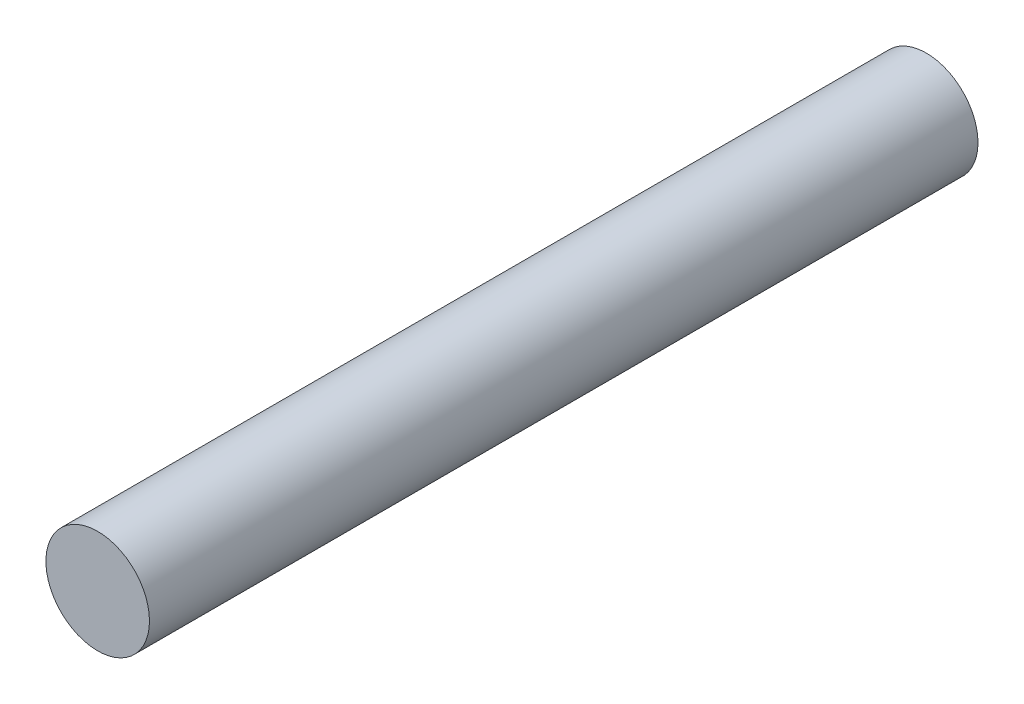
ISO-10303-21;
HEADER;
FILE_DESCRIPTION(('STEP AP214'),'2;1');
FILE_NAME('part.step','',(''),(''),'','','');
FILE_SCHEMA(('AUTOMOTIVE_DESIGN { 1 0 10303 214 1 1 1 1 }'));
ENDSEC;
DATA;
#1=APPLICATION_CONTEXT('core data for automotive mechanical design processes');
#2=APPLICATION_PROTOCOL_DEFINITION('international standard','automotive_design',2000,#1);
#3=PRODUCT_CONTEXT('',#1,'mechanical');
#4=PRODUCT('Part','Part','',(#3));
#5=PRODUCT_RELATED_PRODUCT_CATEGORY('part','',(#4));
#6=PRODUCT_DEFINITION_FORMATION('','',#4);
#7=PRODUCT_DEFINITION_CONTEXT('part definition',#1,'design');
#8=PRODUCT_DEFINITION('design','',#6,#7);
#9=PRODUCT_DEFINITION_SHAPE('','',#8);
#10=(LENGTH_UNIT() NAMED_UNIT(*) SI_UNIT(.MILLI.,.METRE.));
#11=(NAMED_UNIT(*) PLANE_ANGLE_UNIT() SI_UNIT($,.RADIAN.));
#12=(NAMED_UNIT(*) SI_UNIT($,.STERADIAN.) SOLID_ANGLE_UNIT());
#13=UNCERTAINTY_MEASURE_WITH_UNIT(LENGTH_MEASURE(1.E-05),#10,'distance_accuracy_value','');
#14=(GEOMETRIC_REPRESENTATION_CONTEXT(3) GLOBAL_UNCERTAINTY_ASSIGNED_CONTEXT((#13)) GLOBAL_UNIT_ASSIGNED_CONTEXT((#10,
#11,#12)) REPRESENTATION_CONTEXT('',''));
#15=CARTESIAN_POINT('',(0.,0.,0.));
#16=DIRECTION('',(0.,0.,1.));
#17=DIRECTION('',(1.,0.,0.));
#18=AXIS2_PLACEMENT_3D('',#15,#16,#17);
#19=CARTESIAN_POINT('',(0.,0.,-50.8));
#20=DIRECTION('',(0.,0.,-1.));
#21=DIRECTION('',(-1.,0.,0.));
#22=AXIS2_PLACEMENT_3D('',#19,#20,#21);
#23=PLANE('',#22);
#24=CARTESIAN_POINT('',(0.,0.,-50.8));
#25=DIRECTION('',(0.,0.,1.));
#26=DIRECTION('',(1.,0.,0.));
#27=AXIS2_PLACEMENT_3D('',#24,#25,#26);
#28=CIRCLE('',#27,3.175);
#29=CARTESIAN_POINT('',(3.175,0.,-50.8));
#30=VERTEX_POINT('',#29);
#31=EDGE_CURVE('E10',#30,#30,#28,.T.);
#32=ORIENTED_EDGE('',*,*,#31,.F.);
#33=EDGE_LOOP('',(#32));
#34=FACE_BOUND('',#33,.T.);
#35=ADVANCED_FACE('F30',(#34),#23,.T.);
#36=CARTESIAN_POINT('',(0.,0.,0.));
#37=DIRECTION('',(0.,0.,1.));
#38=DIRECTION('',(1.,0.,0.));
#39=AXIS2_PLACEMENT_3D('',#36,#37,#38);
#40=CYLINDRICAL_SURFACE('',#39,3.175);
#41=ORIENTED_EDGE('',*,*,#31,.T.);
#42=EDGE_LOOP('',(#41));
#43=FACE_BOUND('',#42,.T.);
#44=CARTESIAN_POINT('',(0.,0.,0.));
#45=DIRECTION('',(0.,0.,1.));
#46=DIRECTION('',(1.,0.,0.));
#47=AXIS2_PLACEMENT_3D('',#44,#45,#46);
#48=CIRCLE('',#47,3.175);
#49=CARTESIAN_POINT('',(3.175,0.,0.));
#50=VERTEX_POINT('',#49);
#51=EDGE_CURVE('E36',#50,#50,#48,.T.);
#52=ORIENTED_EDGE('',*,*,#51,.F.);
#53=EDGE_LOOP('',(#52));
#54=FACE_BOUND('',#53,.T.);
#55=ADVANCED_FACE('F44',(#43,#54),#40,.T.);
#56=CARTESIAN_POINT('',(0.,0.,0.));
#57=DIRECTION('',(0.,0.,1.));
#58=DIRECTION('',(1.,0.,0.));
#59=AXIS2_PLACEMENT_3D('',#56,#57,#58);
#60=PLANE('',#59);
#61=ORIENTED_EDGE('',*,*,#51,.T.);
#62=EDGE_LOOP('',(#61));
#63=FACE_BOUND('',#62,.T.);
#64=ADVANCED_FACE('F42',(#63),#60,.T.);
#65=CLOSED_SHELL('',(#35,#55,#64));
#66=MANIFOLD_SOLID_BREP('B2',#65);
#67=ADVANCED_BREP_SHAPE_REPRESENTATION('',(#18,#66),#14);
#68=SHAPE_DEFINITION_REPRESENTATION(#9,#67);
ENDSEC;
END-ISO-10303-21;
